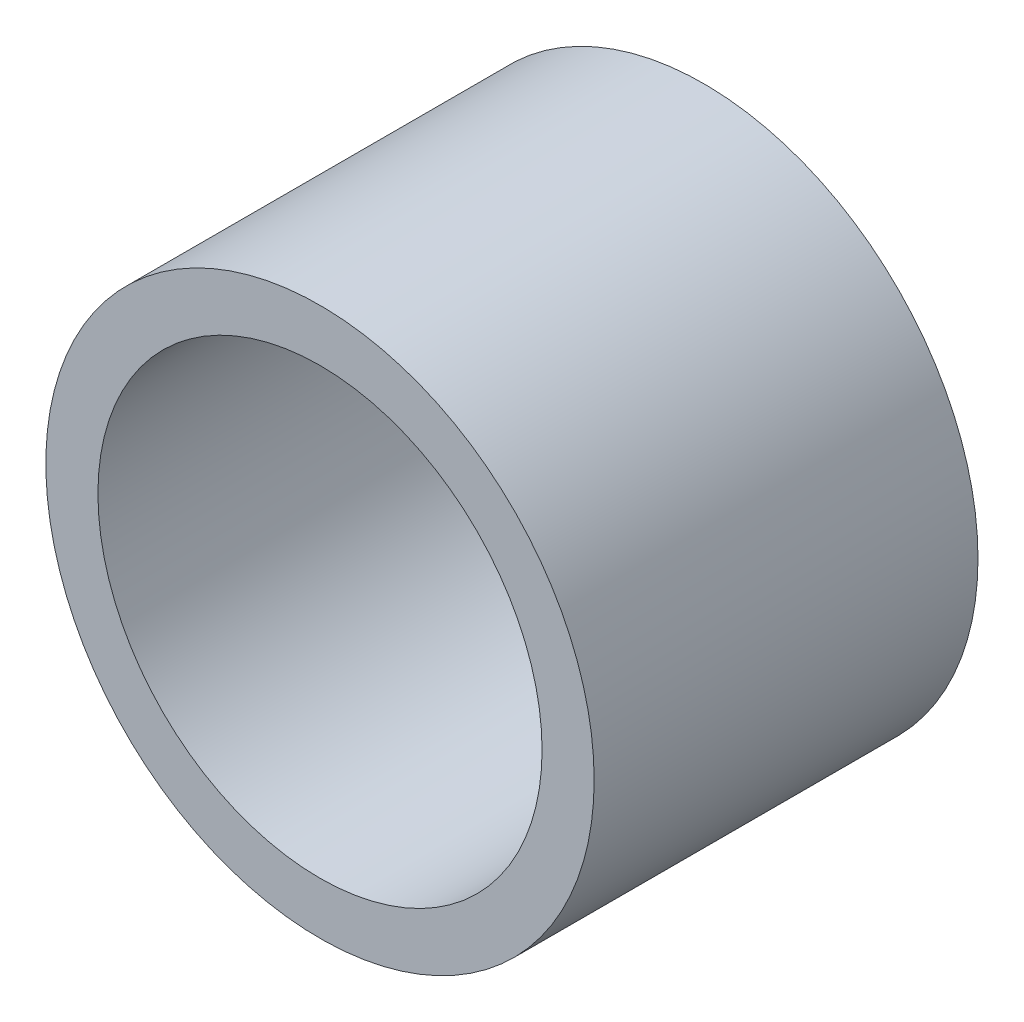
ISO-10303-21;
HEADER;
FILE_DESCRIPTION(('STEP AP214'),'2;1');
FILE_NAME('part.step','',(''),(''),'','','');
FILE_SCHEMA(('AUTOMOTIVE_DESIGN { 1 0 10303 214 1 1 1 1 }'));
ENDSEC;
DATA;
#1=APPLICATION_CONTEXT('core data for automotive mechanical design processes');
#2=APPLICATION_PROTOCOL_DEFINITION('international standard','automotive_design',2000,#1);
#3=PRODUCT_CONTEXT('',#1,'mechanical');
#4=PRODUCT('Part','Part','',(#3));
#5=PRODUCT_RELATED_PRODUCT_CATEGORY('part','',(#4));
#6=PRODUCT_DEFINITION_FORMATION('','',#4);
#7=PRODUCT_DEFINITION_CONTEXT('part definition',#1,'design');
#8=PRODUCT_DEFINITION('design','',#6,#7);
#9=PRODUCT_DEFINITION_SHAPE('','',#8);
#10=(LENGTH_UNIT() NAMED_UNIT(*) SI_UNIT(.MILLI.,.METRE.));
#11=(NAMED_UNIT(*) PLANE_ANGLE_UNIT() SI_UNIT($,.RADIAN.));
#12=(NAMED_UNIT(*) SI_UNIT($,.STERADIAN.) SOLID_ANGLE_UNIT());
#13=UNCERTAINTY_MEASURE_WITH_UNIT(LENGTH_MEASURE(1.E-05),#10,'distance_accuracy_value','');
#14=(GEOMETRIC_REPRESENTATION_CONTEXT(3) GLOBAL_UNCERTAINTY_ASSIGNED_CONTEXT((#13)) GLOBAL_UNIT_ASSIGNED_CONTEXT((#10,
#11,#12)) REPRESENTATION_CONTEXT('',''));
#15=CARTESIAN_POINT('',(0.,0.,0.));
#16=DIRECTION('',(0.,0.,1.));
#17=DIRECTION('',(1.,0.,0.));
#18=AXIS2_PLACEMENT_3D('',#15,#16,#17);
#19=CARTESIAN_POINT('',(0.,0.,7.));
#20=DIRECTION('',(0.,0.,1.));
#21=DIRECTION('',(1.,0.,0.));
#22=AXIS2_PLACEMENT_3D('',#19,#20,#21);
#23=PLANE('',#22);
#24=CARTESIAN_POINT('',(0.,0.,7.));
#25=DIRECTION('',(0.,0.,1.));
#26=DIRECTION('',(1.,0.,0.));
#27=AXIS2_PLACEMENT_3D('',#24,#25,#26);
#28=CIRCLE('',#27,5.);
#29=CARTESIAN_POINT('',(5.,0.,7.));
#30=VERTEX_POINT('',#29);
#31=EDGE_CURVE('E10',#30,#30,#28,.T.);
#32=ORIENTED_EDGE('',*,*,#31,.T.);
#33=EDGE_LOOP('',(#32));
#34=FACE_BOUND('',#33,.T.);
#35=CARTESIAN_POINT('',(0.,0.,7.));
#36=DIRECTION('',(0.,0.,1.));
#37=DIRECTION('',(1.,0.,0.));
#38=AXIS2_PLACEMENT_3D('',#35,#36,#37);
#39=CIRCLE('',#38,4.05);
#40=CARTESIAN_POINT('',(4.05,0.,7.));
#41=VERTEX_POINT('',#40);
#42=EDGE_CURVE('E50',#41,#41,#39,.T.);
#43=ORIENTED_EDGE('',*,*,#42,.F.);
#44=EDGE_LOOP('',(#43));
#45=FACE_BOUND('',#44,.T.);
#46=ADVANCED_FACE('F37',(#34,#45),#23,.T.);
#47=CARTESIAN_POINT('',(0.,0.,0.));
#48=DIRECTION('',(0.,0.,1.));
#49=DIRECTION('',(1.,0.,0.));
#50=AXIS2_PLACEMENT_3D('',#47,#48,#49);
#51=PLANE('',#50);
#52=CARTESIAN_POINT('',(0.,0.,0.));
#53=DIRECTION('',(0.,0.,1.));
#54=DIRECTION('',(1.,0.,0.));
#55=AXIS2_PLACEMENT_3D('',#52,#53,#54);
#56=CIRCLE('',#55,5.);
#57=CARTESIAN_POINT('',(5.,0.,0.));
#58=VERTEX_POINT('',#57);
#59=EDGE_CURVE('E41',#58,#58,#56,.T.);
#60=ORIENTED_EDGE('',*,*,#59,.F.);
#61=EDGE_LOOP('',(#60));
#62=FACE_BOUND('',#61,.T.);
#63=CARTESIAN_POINT('',(0.,0.,0.));
#64=DIRECTION('',(0.,0.,1.));
#65=DIRECTION('',(1.,0.,0.));
#66=AXIS2_PLACEMENT_3D('',#63,#64,#65);
#67=CIRCLE('',#66,4.05);
#68=CARTESIAN_POINT('',(4.05,0.,0.));
#69=VERTEX_POINT('',#68);
#70=EDGE_CURVE('E52',#69,#69,#67,.T.);
#71=ORIENTED_EDGE('',*,*,#70,.T.);
#72=EDGE_LOOP('',(#71));
#73=FACE_BOUND('',#72,.T.);
#74=ADVANCED_FACE('F64',(#62,#73),#51,.F.);
#75=CARTESIAN_POINT('',(0.,0.,7.));
#76=DIRECTION('',(0.,0.,-1.));
#77=DIRECTION('',(-1.,0.,0.));
#78=AXIS2_PLACEMENT_3D('',#75,#76,#77);
#79=CYLINDRICAL_SURFACE('',#78,5.);
#80=ORIENTED_EDGE('',*,*,#31,.F.);
#81=EDGE_LOOP('',(#80));
#82=FACE_BOUND('',#81,.T.);
#83=ORIENTED_EDGE('',*,*,#59,.T.);
#84=EDGE_LOOP('',(#83));
#85=FACE_BOUND('',#84,.T.);
#86=ADVANCED_FACE('F39',(#82,#85),#79,.T.);
#87=CARTESIAN_POINT('',(0.,0.,7.));
#88=DIRECTION('',(0.,0.,-1.));
#89=DIRECTION('',(-1.,0.,0.));
#90=AXIS2_PLACEMENT_3D('',#87,#88,#89);
#91=CYLINDRICAL_SURFACE('',#90,4.05);
#92=ORIENTED_EDGE('',*,*,#42,.T.);
#93=EDGE_LOOP('',(#92));
#94=FACE_BOUND('',#93,.T.);
#95=ORIENTED_EDGE('',*,*,#70,.F.);
#96=EDGE_LOOP('',(#95));
#97=FACE_BOUND('',#96,.T.);
#98=ADVANCED_FACE('F60',(#94,#97),#91,.F.);
#99=CLOSED_SHELL('',(#46,#74,#86,#98));
#100=MANIFOLD_SOLID_BREP('B2',#99);
#101=ADVANCED_BREP_SHAPE_REPRESENTATION('',(#18,#100),#14);
#102=SHAPE_DEFINITION_REPRESENTATION(#9,#101);
ENDSEC;
END-ISO-10303-21;
